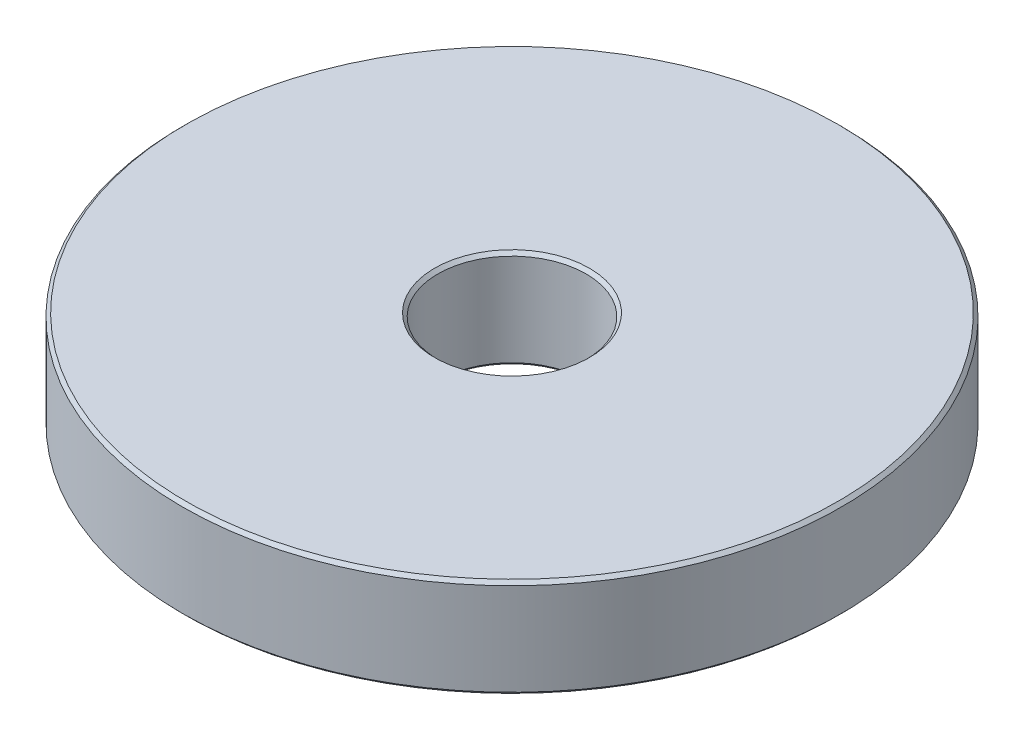
ISO-10303-21;
HEADER;
FILE_DESCRIPTION(('STEP AP214'),'2;1');
FILE_NAME('part.step','',(''),(''),'','','');
FILE_SCHEMA(('AUTOMOTIVE_DESIGN { 1 0 10303 214 1 1 1 1 }'));
ENDSEC;
DATA;
#1=APPLICATION_CONTEXT('core data for automotive mechanical design processes');
#2=APPLICATION_PROTOCOL_DEFINITION('international standard','automotive_design',2000,#1);
#3=PRODUCT_CONTEXT('',#1,'mechanical');
#4=PRODUCT('Part','Part','',(#3));
#5=PRODUCT_RELATED_PRODUCT_CATEGORY('part','',(#4));
#6=PRODUCT_DEFINITION_FORMATION('','',#4);
#7=PRODUCT_DEFINITION_CONTEXT('part definition',#1,'design');
#8=PRODUCT_DEFINITION('design','',#6,#7);
#9=PRODUCT_DEFINITION_SHAPE('','',#8);
#10=(LENGTH_UNIT() NAMED_UNIT(*) SI_UNIT(.MILLI.,.METRE.));
#11=(NAMED_UNIT(*) PLANE_ANGLE_UNIT() SI_UNIT($,.RADIAN.));
#12=(NAMED_UNIT(*) SI_UNIT($,.STERADIAN.) SOLID_ANGLE_UNIT());
#13=UNCERTAINTY_MEASURE_WITH_UNIT(LENGTH_MEASURE(1.E-05),#10,'distance_accuracy_value','');
#14=(GEOMETRIC_REPRESENTATION_CONTEXT(3) GLOBAL_UNCERTAINTY_ASSIGNED_CONTEXT((#13)) GLOBAL_UNIT_ASSIGNED_CONTEXT((#10,
#11,#12)) REPRESENTATION_CONTEXT('',''));
#15=CARTESIAN_POINT('',(0.,0.,0.));
#16=DIRECTION('',(0.,0.,1.));
#17=DIRECTION('',(1.,0.,0.));
#18=AXIS2_PLACEMENT_3D('',#15,#16,#17);
#19=CARTESIAN_POINT('',(0.,-9.3,0.));
#20=DIRECTION('',(0.,-1.,0.));
#21=DIRECTION('',(0.,0.,-1.));
#22=AXIS2_PLACEMENT_3D('',#19,#20,#21);
#23=CONICAL_SURFACE('',#22,4.5,0.785398163397448);
#24=CARTESIAN_POINT('',(0.,-9.5,0.));
#25=DIRECTION('',(0.,-1.,0.));
#26=DIRECTION('',(0.,0.,-1.));
#27=AXIS2_PLACEMENT_3D('',#24,#25,#26);
#28=CIRCLE('',#27,4.7);
#29=CARTESIAN_POINT('',(0.,-9.5,-4.7));
#30=VERTEX_POINT('',#29);
#31=EDGE_CURVE('E12',#30,#30,#28,.T.);
#32=ORIENTED_EDGE('',*,*,#31,.T.);
#33=EDGE_LOOP('',(#32));
#34=FACE_BOUND('',#33,.T.);
#35=CARTESIAN_POINT('',(0.,-9.3,0.));
#36=DIRECTION('',(0.,-1.,0.));
#37=DIRECTION('',(0.,0.,-1.));
#38=AXIS2_PLACEMENT_3D('',#35,#36,#37);
#39=CIRCLE('',#38,4.5);
#40=CARTESIAN_POINT('',(0.,-9.3,-4.5));
#41=VERTEX_POINT('',#40);
#42=EDGE_CURVE('E73',#41,#41,#39,.T.);
#43=ORIENTED_EDGE('',*,*,#42,.F.);
#44=EDGE_LOOP('',(#43));
#45=FACE_BOUND('',#44,.T.);
#46=ADVANCED_FACE('F45',(#34,#45),#23,.F.);
#47=CARTESIAN_POINT('',(4.7,-9.5,0.));
#48=DIRECTION('',(0.,-1.,0.));
#49=DIRECTION('',(0.,0.,-1.));
#50=AXIS2_PLACEMENT_3D('',#47,#48,#49);
#51=PLANE('',#50);
#52=CARTESIAN_POINT('',(0.,-9.5,0.));
#53=DIRECTION('',(0.,-1.,0.));
#54=DIRECTION('',(0.,0.,-1.));
#55=AXIS2_PLACEMENT_3D('',#52,#53,#54);
#56=CIRCLE('',#55,19.8);
#57=CARTESIAN_POINT('',(0.,-9.5,-19.8));
#58=VERTEX_POINT('',#57);
#59=EDGE_CURVE('E51',#58,#58,#56,.T.);
#60=ORIENTED_EDGE('',*,*,#59,.T.);
#61=EDGE_LOOP('',(#60));
#62=FACE_BOUND('',#61,.T.);
#63=ORIENTED_EDGE('',*,*,#31,.F.);
#64=EDGE_LOOP('',(#63));
#65=FACE_BOUND('',#64,.T.);
#66=ADVANCED_FACE('F81',(#62,#65),#51,.T.);
#67=CARTESIAN_POINT('',(0.,-9.5,0.));
#68=DIRECTION('',(0.,1.,0.));
#69=DIRECTION('',(0.,0.,1.));
#70=AXIS2_PLACEMENT_3D('',#67,#68,#69);
#71=CONICAL_SURFACE('',#70,19.8,0.785398163397448);
#72=CARTESIAN_POINT('',(0.,-9.3,0.));
#73=DIRECTION('',(0.,-1.,0.));
#74=DIRECTION('',(0.,0.,-1.));
#75=AXIS2_PLACEMENT_3D('',#72,#73,#74);
#76=CIRCLE('',#75,20.);
#77=CARTESIAN_POINT('',(0.,-9.3,-20.));
#78=VERTEX_POINT('',#77);
#79=EDGE_CURVE('E55',#78,#78,#76,.T.);
#80=ORIENTED_EDGE('',*,*,#79,.T.);
#81=EDGE_LOOP('',(#80));
#82=FACE_BOUND('',#81,.T.);
#83=ORIENTED_EDGE('',*,*,#59,.F.);
#84=EDGE_LOOP('',(#83));
#85=FACE_BOUND('',#84,.T.);
#86=ADVANCED_FACE('F85',(#82,#85),#71,.T.);
#87=CARTESIAN_POINT('',(0.,9.5,0.));
#88=DIRECTION('',(0.,-1.,0.));
#89=DIRECTION('',(0.,0.,-1.));
#90=AXIS2_PLACEMENT_3D('',#87,#88,#89);
#91=CYLINDRICAL_SURFACE('',#90,20.);
#92=CARTESIAN_POINT('',(0.,-3.7,0.));
#93=DIRECTION('',(0.,-1.,0.));
#94=DIRECTION('',(0.,0.,-1.));
#95=AXIS2_PLACEMENT_3D('',#92,#93,#94);
#96=CIRCLE('',#95,20.);
#97=CARTESIAN_POINT('',(0.,-3.7,-20.));
#98=VERTEX_POINT('',#97);
#99=EDGE_CURVE('E59',#98,#98,#96,.T.);
#100=ORIENTED_EDGE('',*,*,#99,.T.);
#101=EDGE_LOOP('',(#100));
#102=FACE_BOUND('',#101,.T.);
#103=ORIENTED_EDGE('',*,*,#79,.F.);
#104=EDGE_LOOP('',(#103));
#105=FACE_BOUND('',#104,.T.);
#106=ADVANCED_FACE('F89',(#102,#105),#91,.T.);
#107=CARTESIAN_POINT('',(0.,-3.7,0.));
#108=DIRECTION('',(0.,-1.,0.));
#109=DIRECTION('',(0.,0.,-1.));
#110=AXIS2_PLACEMENT_3D('',#107,#108,#109);
#111=CONICAL_SURFACE('',#110,20.,0.785398163397444);
#112=CARTESIAN_POINT('',(0.,-3.5,0.));
#113=DIRECTION('',(0.,-1.,0.));
#114=DIRECTION('',(0.,0.,-1.));
#115=AXIS2_PLACEMENT_3D('',#112,#113,#114);
#116=CIRCLE('',#115,19.8);
#117=CARTESIAN_POINT('',(0.,-3.5,-19.8));
#118=VERTEX_POINT('',#117);
#119=EDGE_CURVE('E64',#118,#118,#116,.T.);
#120=ORIENTED_EDGE('',*,*,#119,.T.);
#121=EDGE_LOOP('',(#120));
#122=FACE_BOUND('',#121,.T.);
#123=ORIENTED_EDGE('',*,*,#99,.F.);
#124=EDGE_LOOP('',(#123));
#125=FACE_BOUND('',#124,.T.);
#126=ADVANCED_FACE('F96',(#122,#125),#111,.T.);
#127=CARTESIAN_POINT('',(4.7,-3.5,0.));
#128=DIRECTION('',(0.,1.,0.));
#129=DIRECTION('',(0.,0.,1.));
#130=AXIS2_PLACEMENT_3D('',#127,#128,#129);
#131=PLANE('',#130);
#132=CARTESIAN_POINT('',(0.,-3.5,0.));
#133=DIRECTION('',(0.,-1.,0.));
#134=DIRECTION('',(0.,0.,-1.));
#135=AXIS2_PLACEMENT_3D('',#132,#133,#134);
#136=CIRCLE('',#135,4.7);
#137=CARTESIAN_POINT('',(0.,-3.5,-4.7));
#138=VERTEX_POINT('',#137);
#139=EDGE_CURVE('E67',#138,#138,#136,.T.);
#140=ORIENTED_EDGE('',*,*,#139,.T.);
#141=EDGE_LOOP('',(#140));
#142=FACE_BOUND('',#141,.T.);
#143=ORIENTED_EDGE('',*,*,#119,.F.);
#144=EDGE_LOOP('',(#143));
#145=FACE_BOUND('',#144,.T.);
#146=ADVANCED_FACE('F100',(#142,#145),#131,.T.);
#147=CARTESIAN_POINT('',(0.,-3.5,0.));
#148=DIRECTION('',(0.,1.,0.));
#149=DIRECTION('',(0.,0.,1.));
#150=AXIS2_PLACEMENT_3D('',#147,#148,#149);
#151=CONICAL_SURFACE('',#150,4.7,0.785398163397446);
#152=CARTESIAN_POINT('',(0.,-3.7,0.));
#153=DIRECTION('',(0.,-1.,0.));
#154=DIRECTION('',(0.,0.,-1.));
#155=AXIS2_PLACEMENT_3D('',#152,#153,#154);
#156=CIRCLE('',#155,4.5);
#157=CARTESIAN_POINT('',(0.,-3.7,-4.5));
#158=VERTEX_POINT('',#157);
#159=EDGE_CURVE('E70',#158,#158,#156,.T.);
#160=ORIENTED_EDGE('',*,*,#159,.T.);
#161=EDGE_LOOP('',(#160));
#162=FACE_BOUND('',#161,.T.);
#163=ORIENTED_EDGE('',*,*,#139,.F.);
#164=EDGE_LOOP('',(#163));
#165=FACE_BOUND('',#164,.T.);
#166=ADVANCED_FACE('F104',(#162,#165),#151,.F.);
#167=CARTESIAN_POINT('',(0.,9.5,0.));
#168=DIRECTION('',(0.,-1.,0.));
#169=DIRECTION('',(0.,0.,-1.));
#170=AXIS2_PLACEMENT_3D('',#167,#168,#169);
#171=CYLINDRICAL_SURFACE('',#170,4.5);
#172=ORIENTED_EDGE('',*,*,#42,.T.);
#173=EDGE_LOOP('',(#172));
#174=FACE_BOUND('',#173,.T.);
#175=ORIENTED_EDGE('',*,*,#159,.F.);
#176=EDGE_LOOP('',(#175));
#177=FACE_BOUND('',#176,.T.);
#178=ADVANCED_FACE('F77',(#174,#177),#171,.F.);
#179=CLOSED_SHELL('',(#46,#66,#86,#106,#126,#146,#166,#178));
#180=MANIFOLD_SOLID_BREP('B2',#179);
#181=ADVANCED_BREP_SHAPE_REPRESENTATION('',(#18,#180),#14);
#182=SHAPE_DEFINITION_REPRESENTATION(#9,#181);
ENDSEC;
END-ISO-10303-21;
